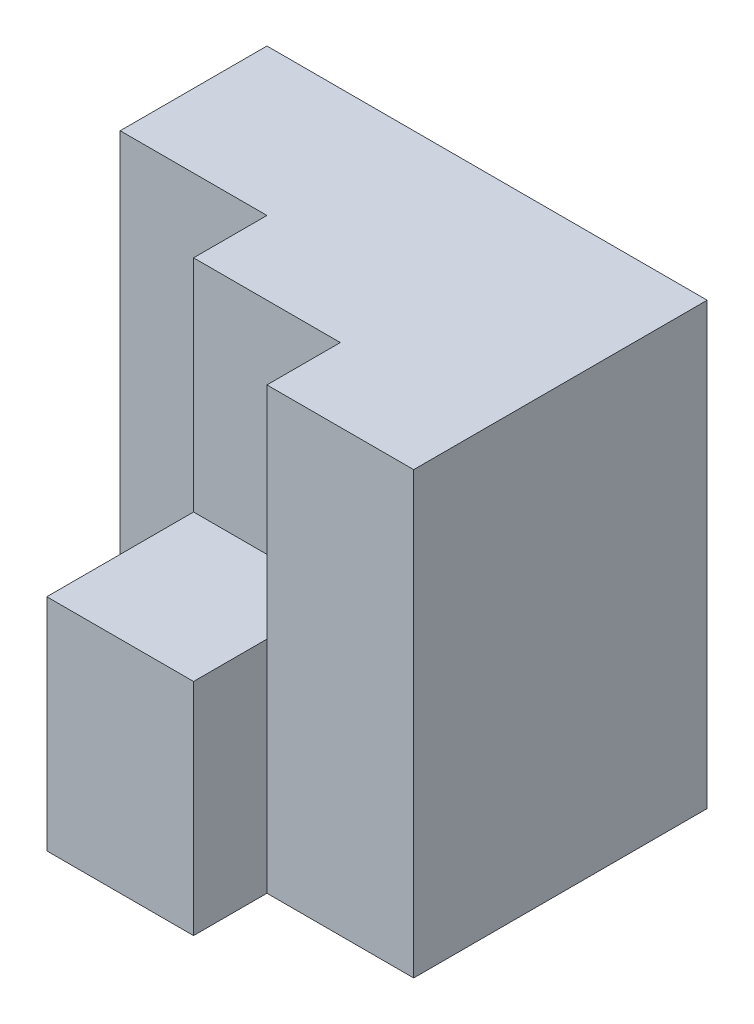
ISO-10303-21;
HEADER;
FILE_DESCRIPTION(('STEP AP214'),'2;1');
FILE_NAME('part.step','',(''),(''),'','','');
FILE_SCHEMA(('AUTOMOTIVE_DESIGN { 1 0 10303 214 1 1 1 1 }'));
ENDSEC;
DATA;
#1=APPLICATION_CONTEXT('core data for automotive mechanical design processes');
#2=APPLICATION_PROTOCOL_DEFINITION('international standard','automotive_design',2000,#1);
#3=PRODUCT_CONTEXT('',#1,'mechanical');
#4=PRODUCT('Part','Part','',(#3));
#5=PRODUCT_RELATED_PRODUCT_CATEGORY('part','',(#4));
#6=PRODUCT_DEFINITION_FORMATION('','',#4);
#7=PRODUCT_DEFINITION_CONTEXT('part definition',#1,'design');
#8=PRODUCT_DEFINITION('design','',#6,#7);
#9=PRODUCT_DEFINITION_SHAPE('','',#8);
#10=(LENGTH_UNIT() NAMED_UNIT(*) SI_UNIT(.MILLI.,.METRE.));
#11=(NAMED_UNIT(*) PLANE_ANGLE_UNIT() SI_UNIT($,.RADIAN.));
#12=(NAMED_UNIT(*) SI_UNIT($,.STERADIAN.) SOLID_ANGLE_UNIT());
#13=UNCERTAINTY_MEASURE_WITH_UNIT(LENGTH_MEASURE(1.E-05),#10,'distance_accuracy_value','');
#14=(GEOMETRIC_REPRESENTATION_CONTEXT(3) GLOBAL_UNCERTAINTY_ASSIGNED_CONTEXT((#13)) GLOBAL_UNIT_ASSIGNED_CONTEXT((#10,
#11,#12)) REPRESENTATION_CONTEXT('',''));
#15=CARTESIAN_POINT('',(0.,0.,0.));
#16=DIRECTION('',(0.,0.,1.));
#17=DIRECTION('',(1.,0.,0.));
#18=AXIS2_PLACEMENT_3D('',#15,#16,#17);
#19=CARTESIAN_POINT('',(0.,0.,25.));
#20=DIRECTION('',(0.,0.,-1.));
#21=DIRECTION('',(-1.,0.,0.));
#22=AXIS2_PLACEMENT_3D('',#19,#20,#21);
#23=PLANE('',#22);
#24=DIRECTION('',(1.,0.,0.));
#25=VECTOR('',#24,1.);
#26=CARTESIAN_POINT('',(20.,15.,25.));
#27=LINE('',#26,#25);
#28=CARTESIAN_POINT('',(10.,15.,25.));
#29=VERTEX_POINT('',#28);
#30=CARTESIAN_POINT('',(20.,15.,25.));
#31=VERTEX_POINT('',#30);
#32=EDGE_CURVE('E128',#29,#31,#27,.T.);
#33=ORIENTED_EDGE('',*,*,#32,.F.);
#34=DIRECTION('',(0.,1.,0.));
#35=VECTOR('',#34,1.);
#36=CARTESIAN_POINT('',(10.,0.,25.));
#37=LINE('',#36,#35);
#38=CARTESIAN_POINT('',(10.,0.,25.));
#39=VERTEX_POINT('',#38);
#40=EDGE_CURVE('E140',#39,#29,#37,.T.);
#41=ORIENTED_EDGE('',*,*,#40,.F.);
#42=DIRECTION('',(1.,0.,0.));
#43=VECTOR('',#42,1.);
#44=CARTESIAN_POINT('',(0.,0.,25.));
#45=LINE('',#44,#43);
#46=CARTESIAN_POINT('',(20.,0.,25.));
#47=VERTEX_POINT('',#46);
#48=EDGE_CURVE('E174',#39,#47,#45,.T.);
#49=ORIENTED_EDGE('',*,*,#48,.T.);
#50=DIRECTION('',(0.,-1.,0.));
#51=VECTOR('',#50,1.);
#52=CARTESIAN_POINT('',(20.,0.,25.));
#53=LINE('',#52,#51);
#54=EDGE_CURVE('E156',#31,#47,#53,.T.);
#55=ORIENTED_EDGE('',*,*,#54,.F.);
#56=EDGE_LOOP('',(#33,#41,#49,#55));
#57=FACE_BOUND('',#56,.T.);
#58=ADVANCED_FACE('F33',(#57),#23,.F.);
#59=CARTESIAN_POINT('',(20.,0.,20.));
#60=DIRECTION('',(-1.,0.,0.));
#61=DIRECTION('',(0.,0.,1.));
#62=AXIS2_PLACEMENT_3D('',#59,#60,#61);
#63=PLANE('',#62);
#64=DIRECTION('',(0.,0.,-1.));
#65=VECTOR('',#64,1.);
#66=CARTESIAN_POINT('',(20.,15.,25.));
#67=LINE('',#66,#65);
#68=CARTESIAN_POINT('',(20.,15.,20.));
#69=VERTEX_POINT('',#68);
#70=EDGE_CURVE('E115',#31,#69,#67,.T.);
#71=ORIENTED_EDGE('',*,*,#70,.F.);
#72=ORIENTED_EDGE('',*,*,#54,.T.);
#73=DIRECTION('',(0.,0.,1.));
#74=VECTOR('',#73,1.);
#75=CARTESIAN_POINT('',(20.,0.,20.));
#76=LINE('',#75,#74);
#77=CARTESIAN_POINT('',(20.,0.,20.));
#78=VERTEX_POINT('',#77);
#79=EDGE_CURVE('E169',#78,#47,#76,.T.);
#80=ORIENTED_EDGE('',*,*,#79,.F.);
#81=DIRECTION('',(0.,-1.,0.));
#82=VECTOR('',#81,1.);
#83=CARTESIAN_POINT('',(20.,0.,20.));
#84=LINE('',#83,#82);
#85=EDGE_CURVE('E163',#69,#78,#84,.T.);
#86=ORIENTED_EDGE('',*,*,#85,.F.);
#87=EDGE_LOOP('',(#71,#72,#80,#86));
#88=FACE_BOUND('',#87,.T.);
#89=ADVANCED_FACE('F217',(#88),#63,.F.);
#90=CARTESIAN_POINT('',(30.,0.,25.));
#91=DIRECTION('',(-1.,0.,0.));
#92=DIRECTION('',(0.,0.,1.));
#93=AXIS2_PLACEMENT_3D('',#90,#91,#92);
#94=PLANE('',#93);
#95=DIRECTION('',(0.,1.,0.));
#96=VECTOR('',#95,1.);
#97=CARTESIAN_POINT('',(30.,0.,20.));
#98=LINE('',#97,#96);
#99=CARTESIAN_POINT('',(30.,0.,20.));
#100=VERTEX_POINT('',#99);
#101=CARTESIAN_POINT('',(30.,30.,20.));
#102=VERTEX_POINT('',#101);
#103=EDGE_CURVE('E158',#100,#102,#98,.T.);
#104=ORIENTED_EDGE('',*,*,#103,.F.);
#105=DIRECTION('',(0.,0.,-1.));
#106=VECTOR('',#105,1.);
#107=CARTESIAN_POINT('',(30.,0.,25.));
#108=LINE('',#107,#106);
#109=CARTESIAN_POINT('',(30.,0.,0.));
#110=VERTEX_POINT('',#109);
#111=EDGE_CURVE('E41',#100,#110,#108,.T.);
#112=ORIENTED_EDGE('',*,*,#111,.T.);
#113=DIRECTION('',(0.,1.,0.));
#114=VECTOR('',#113,1.);
#115=CARTESIAN_POINT('',(30.,0.,0.));
#116=LINE('',#115,#114);
#117=CARTESIAN_POINT('',(30.,30.,0.));
#118=VERTEX_POINT('',#117);
#119=EDGE_CURVE('E184',#110,#118,#116,.T.);
#120=ORIENTED_EDGE('',*,*,#119,.T.);
#121=DIRECTION('',(0.,0.,-1.));
#122=VECTOR('',#121,1.);
#123=CARTESIAN_POINT('',(30.,30.,25.));
#124=LINE('',#123,#122);
#125=EDGE_CURVE('E190',#102,#118,#124,.T.);
#126=ORIENTED_EDGE('',*,*,#125,.F.);
#127=EDGE_LOOP('',(#104,#112,#120,#126));
#128=FACE_BOUND('',#127,.T.);
#129=ADVANCED_FACE('F194',(#128),#94,.F.);
#130=CARTESIAN_POINT('',(0.,0.,25.));
#131=DIRECTION('',(1.,0.,0.));
#132=DIRECTION('',(0.,0.,-1.));
#133=AXIS2_PLACEMENT_3D('',#130,#131,#132);
#134=PLANE('',#133);
#135=DIRECTION('',(0.,0.,-1.));
#136=VECTOR('',#135,1.);
#137=CARTESIAN_POINT('',(0.,0.,25.));
#138=LINE('',#137,#136);
#139=CARTESIAN_POINT('',(0.,0.,10.));
#140=VERTEX_POINT('',#139);
#141=CARTESIAN_POINT('',(0.,0.,0.));
#142=VERTEX_POINT('',#141);
#143=EDGE_CURVE('E11',#140,#142,#138,.T.);
#144=ORIENTED_EDGE('',*,*,#143,.F.);
#145=DIRECTION('',(0.,-1.,0.));
#146=VECTOR('',#145,1.);
#147=CARTESIAN_POINT('',(0.,0.,10.));
#148=LINE('',#147,#146);
#149=CARTESIAN_POINT('',(0.,30.,10.));
#150=VERTEX_POINT('',#149);
#151=EDGE_CURVE('E142',#150,#140,#148,.T.);
#152=ORIENTED_EDGE('',*,*,#151,.F.);
#153=DIRECTION('',(0.,0.,-1.));
#154=VECTOR('',#153,1.);
#155=CARTESIAN_POINT('',(0.,30.,25.));
#156=LINE('',#155,#154);
#157=CARTESIAN_POINT('',(0.,30.,0.));
#158=VERTEX_POINT('',#157);
#159=EDGE_CURVE('E177',#150,#158,#156,.T.);
#160=ORIENTED_EDGE('',*,*,#159,.T.);
#161=DIRECTION('',(0.,-1.,0.));
#162=VECTOR('',#161,1.);
#163=CARTESIAN_POINT('',(0.,0.,0.));
#164=LINE('',#163,#162);
#165=EDGE_CURVE('E173',#158,#142,#164,.T.);
#166=ORIENTED_EDGE('',*,*,#165,.T.);
#167=EDGE_LOOP('',(#144,#152,#160,#166));
#168=FACE_BOUND('',#167,.T.);
#169=ADVANCED_FACE('F35',(#168),#134,.F.);
#170=CARTESIAN_POINT('',(0.,0.,25.));
#171=DIRECTION('',(0.,1.,0.));
#172=DIRECTION('',(0.,0.,1.));
#173=AXIS2_PLACEMENT_3D('',#170,#171,#172);
#174=PLANE('',#173);
#175=ORIENTED_EDGE('',*,*,#48,.F.);
#176=DIRECTION('',(0.,0.,1.));
#177=VECTOR('',#176,1.);
#178=CARTESIAN_POINT('',(10.,0.,10.));
#179=LINE('',#178,#177);
#180=CARTESIAN_POINT('',(10.,0.,10.));
#181=VERTEX_POINT('',#180);
#182=EDGE_CURVE('E56',#181,#39,#179,.T.);
#183=ORIENTED_EDGE('',*,*,#182,.F.);
#184=DIRECTION('',(1.,0.,0.));
#185=VECTOR('',#184,1.);
#186=CARTESIAN_POINT('',(0.,0.,10.));
#187=LINE('',#186,#185);
#188=EDGE_CURVE('E144',#140,#181,#187,.T.);
#189=ORIENTED_EDGE('',*,*,#188,.F.);
#190=ORIENTED_EDGE('',*,*,#143,.T.);
#191=DIRECTION('',(1.,0.,0.));
#192=VECTOR('',#191,1.);
#193=CARTESIAN_POINT('',(0.,0.,0.));
#194=LINE('',#193,#192);
#195=EDGE_CURVE('E181',#142,#110,#194,.T.);
#196=ORIENTED_EDGE('',*,*,#195,.T.);
#197=ORIENTED_EDGE('',*,*,#111,.F.);
#198=DIRECTION('',(1.,0.,0.));
#199=VECTOR('',#198,1.);
#200=CARTESIAN_POINT('',(30.,0.,20.));
#201=LINE('',#200,#199);
#202=EDGE_CURVE('E167',#78,#100,#201,.T.);
#203=ORIENTED_EDGE('',*,*,#202,.F.);
#204=ORIENTED_EDGE('',*,*,#79,.T.);
#205=EDGE_LOOP('',(#175,#183,#189,#190,#196,#197,#203,#204));
#206=FACE_BOUND('',#205,.T.);
#207=ADVANCED_FACE('F202',(#206),#174,.F.);
#208=CARTESIAN_POINT('',(0.,30.,25.));
#209=DIRECTION('',(0.,-1.,0.));
#210=DIRECTION('',(0.,0.,-1.));
#211=AXIS2_PLACEMENT_3D('',#208,#209,#210);
#212=PLANE('',#211);
#213=DIRECTION('',(-1.,0.,0.));
#214=VECTOR('',#213,1.);
#215=CARTESIAN_POINT('',(20.,30.,15.));
#216=LINE('',#215,#214);
#217=CARTESIAN_POINT('',(20.,30.,15.));
#218=VERTEX_POINT('',#217);
#219=CARTESIAN_POINT('',(10.,30.,15.));
#220=VERTEX_POINT('',#219);
#221=EDGE_CURVE('E118',#218,#220,#216,.T.);
#222=ORIENTED_EDGE('',*,*,#221,.F.);
#223=DIRECTION('',(0.,0.,-1.));
#224=VECTOR('',#223,1.);
#225=CARTESIAN_POINT('',(20.,30.,25.));
#226=LINE('',#225,#224);
#227=CARTESIAN_POINT('',(20.,30.,20.));
#228=VERTEX_POINT('',#227);
#229=EDGE_CURVE('E124',#228,#218,#226,.T.);
#230=ORIENTED_EDGE('',*,*,#229,.F.);
#231=DIRECTION('',(-1.,0.,0.));
#232=VECTOR('',#231,1.);
#233=CARTESIAN_POINT('',(30.,30.,20.));
#234=LINE('',#233,#232);
#235=EDGE_CURVE('E160',#102,#228,#234,.T.);
#236=ORIENTED_EDGE('',*,*,#235,.F.);
#237=ORIENTED_EDGE('',*,*,#125,.T.);
#238=DIRECTION('',(-1.,0.,0.));
#239=VECTOR('',#238,1.);
#240=CARTESIAN_POINT('',(0.,30.,0.));
#241=LINE('',#240,#239);
#242=EDGE_CURVE('E178',#118,#158,#241,.T.);
#243=ORIENTED_EDGE('',*,*,#242,.T.);
#244=ORIENTED_EDGE('',*,*,#159,.F.);
#245=DIRECTION('',(-1.,0.,0.));
#246=VECTOR('',#245,1.);
#247=CARTESIAN_POINT('',(0.,30.,10.));
#248=LINE('',#247,#246);
#249=CARTESIAN_POINT('',(10.,30.,10.));
#250=VERTEX_POINT('',#249);
#251=EDGE_CURVE('E150',#250,#150,#248,.T.);
#252=ORIENTED_EDGE('',*,*,#251,.F.);
#253=DIRECTION('',(0.,0.,1.));
#254=VECTOR('',#253,1.);
#255=CARTESIAN_POINT('',(10.,30.,10.));
#256=LINE('',#255,#254);
#257=EDGE_CURVE('E153',#250,#220,#256,.T.);
#258=ORIENTED_EDGE('',*,*,#257,.T.);
#259=EDGE_LOOP('',(#222,#230,#236,#237,#243,#244,#252,#258));
#260=FACE_BOUND('',#259,.T.);
#261=ADVANCED_FACE('F210',(#260),#212,.F.);
#262=CARTESIAN_POINT('',(0.,0.,0.));
#263=DIRECTION('',(0.,0.,-1.));
#264=DIRECTION('',(-1.,0.,0.));
#265=AXIS2_PLACEMENT_3D('',#262,#263,#264);
#266=PLANE('',#265);
#267=ORIENTED_EDGE('',*,*,#165,.F.);
#268=ORIENTED_EDGE('',*,*,#242,.F.);
#269=ORIENTED_EDGE('',*,*,#119,.F.);
#270=ORIENTED_EDGE('',*,*,#195,.F.);
#271=EDGE_LOOP('',(#267,#268,#269,#270));
#272=FACE_BOUND('',#271,.T.);
#273=ADVANCED_FACE('F207',(#272),#266,.T.);
#274=CARTESIAN_POINT('',(0.,0.,20.));
#275=DIRECTION('',(0.,0.,1.));
#276=DIRECTION('',(1.,0.,0.));
#277=AXIS2_PLACEMENT_3D('',#274,#275,#276);
#278=PLANE('',#277);
#279=ORIENTED_EDGE('',*,*,#103,.T.);
#280=ORIENTED_EDGE('',*,*,#235,.T.);
#281=EDGE_CURVE('E164',#228,#69,#84,.T.);
#282=ORIENTED_EDGE('',*,*,#281,.T.);
#283=ORIENTED_EDGE('',*,*,#85,.T.);
#284=ORIENTED_EDGE('',*,*,#202,.T.);
#285=EDGE_LOOP('',(#279,#280,#282,#283,#284));
#286=FACE_BOUND('',#285,.T.);
#287=ADVANCED_FACE('F214',(#286),#278,.T.);
#288=CARTESIAN_POINT('',(10.,0.,10.));
#289=DIRECTION('',(1.,0.,0.));
#290=DIRECTION('',(0.,0.,-1.));
#291=AXIS2_PLACEMENT_3D('',#288,#289,#290);
#292=PLANE('',#291);
#293=DIRECTION('',(0.,0.,1.));
#294=VECTOR('',#293,1.);
#295=CARTESIAN_POINT('',(10.,15.,25.));
#296=LINE('',#295,#294);
#297=CARTESIAN_POINT('',(10.,15.,15.));
#298=VERTEX_POINT('',#297);
#299=EDGE_CURVE('E133',#298,#29,#296,.T.);
#300=ORIENTED_EDGE('',*,*,#299,.F.);
#301=DIRECTION('',(0.,1.,0.));
#302=VECTOR('',#301,1.);
#303=CARTESIAN_POINT('',(10.,15.,15.));
#304=LINE('',#303,#302);
#305=EDGE_CURVE('E127',#298,#220,#304,.T.);
#306=ORIENTED_EDGE('',*,*,#305,.T.);
#307=ORIENTED_EDGE('',*,*,#257,.F.);
#308=DIRECTION('',(0.,1.,0.));
#309=VECTOR('',#308,1.);
#310=CARTESIAN_POINT('',(10.,0.,10.));
#311=LINE('',#310,#309);
#312=EDGE_CURVE('E147',#181,#250,#311,.T.);
#313=ORIENTED_EDGE('',*,*,#312,.F.);
#314=ORIENTED_EDGE('',*,*,#182,.T.);
#315=ORIENTED_EDGE('',*,*,#40,.T.);
#316=EDGE_LOOP('',(#300,#306,#307,#313,#314,#315));
#317=FACE_BOUND('',#316,.T.);
#318=ADVANCED_FACE('F221',(#317),#292,.F.);
#319=CARTESIAN_POINT('',(0.,0.,10.));
#320=DIRECTION('',(0.,0.,-1.));
#321=DIRECTION('',(-1.,0.,0.));
#322=AXIS2_PLACEMENT_3D('',#319,#320,#321);
#323=PLANE('',#322);
#324=ORIENTED_EDGE('',*,*,#151,.T.);
#325=ORIENTED_EDGE('',*,*,#188,.T.);
#326=ORIENTED_EDGE('',*,*,#312,.T.);
#327=ORIENTED_EDGE('',*,*,#251,.T.);
#328=EDGE_LOOP('',(#324,#325,#326,#327));
#329=FACE_BOUND('',#328,.T.);
#330=ADVANCED_FACE('F224',(#329),#323,.F.);
#331=CARTESIAN_POINT('',(20.,15.,25.));
#332=DIRECTION('',(1.,0.,0.));
#333=DIRECTION('',(0.,0.,-1.));
#334=AXIS2_PLACEMENT_3D('',#331,#332,#333);
#335=PLANE('',#334);
#336=ORIENTED_EDGE('',*,*,#281,.F.);
#337=ORIENTED_EDGE('',*,*,#229,.T.);
#338=DIRECTION('',(0.,1.,0.));
#339=VECTOR('',#338,1.);
#340=CARTESIAN_POINT('',(20.,15.,15.));
#341=LINE('',#340,#339);
#342=CARTESIAN_POINT('',(20.,15.,15.));
#343=VERTEX_POINT('',#342);
#344=EDGE_CURVE('E121',#343,#218,#341,.T.);
#345=ORIENTED_EDGE('',*,*,#344,.F.);
#346=EDGE_CURVE('E111',#69,#343,#67,.T.);
#347=ORIENTED_EDGE('',*,*,#346,.F.);
#348=EDGE_LOOP('',(#336,#337,#345,#347));
#349=FACE_BOUND('',#348,.T.);
#350=ADVANCED_FACE('F122',(#349),#335,.F.);
#351=CARTESIAN_POINT('',(20.,15.,15.));
#352=DIRECTION('',(0.,0.,-1.));
#353=DIRECTION('',(-1.,0.,0.));
#354=AXIS2_PLACEMENT_3D('',#351,#352,#353);
#355=PLANE('',#354);
#356=ORIENTED_EDGE('',*,*,#221,.T.);
#357=ORIENTED_EDGE('',*,*,#305,.F.);
#358=DIRECTION('',(-1.,0.,0.));
#359=VECTOR('',#358,1.);
#360=CARTESIAN_POINT('',(20.,15.,15.));
#361=LINE('',#360,#359);
#362=EDGE_CURVE('E48',#343,#298,#361,.T.);
#363=ORIENTED_EDGE('',*,*,#362,.F.);
#364=ORIENTED_EDGE('',*,*,#344,.T.);
#365=EDGE_LOOP('',(#356,#357,#363,#364));
#366=FACE_BOUND('',#365,.T.);
#367=ADVANCED_FACE('F130',(#366),#355,.F.);
#368=CARTESIAN_POINT('',(0.,15.,0.));
#369=DIRECTION('',(0.,1.,0.));
#370=DIRECTION('',(0.,0.,1.));
#371=AXIS2_PLACEMENT_3D('',#368,#369,#370);
#372=PLANE('',#371);
#373=ORIENTED_EDGE('',*,*,#70,.T.);
#374=ORIENTED_EDGE('',*,*,#346,.T.);
#375=ORIENTED_EDGE('',*,*,#362,.T.);
#376=ORIENTED_EDGE('',*,*,#299,.T.);
#377=ORIENTED_EDGE('',*,*,#32,.T.);
#378=EDGE_LOOP('',(#373,#374,#375,#376,#377));
#379=FACE_BOUND('',#378,.T.);
#380=ADVANCED_FACE('F113',(#379),#372,.T.);
#381=CLOSED_SHELL('',(#58,#89,#129,#169,#207,#261,#273,#287,#318,#330,#350,#367,#380));
#382=MANIFOLD_SOLID_BREP('B2',#381);
#383=ADVANCED_BREP_SHAPE_REPRESENTATION('',(#18,#382),#14);
#384=SHAPE_DEFINITION_REPRESENTATION(#9,#383);
ENDSEC;
END-ISO-10303-21;
